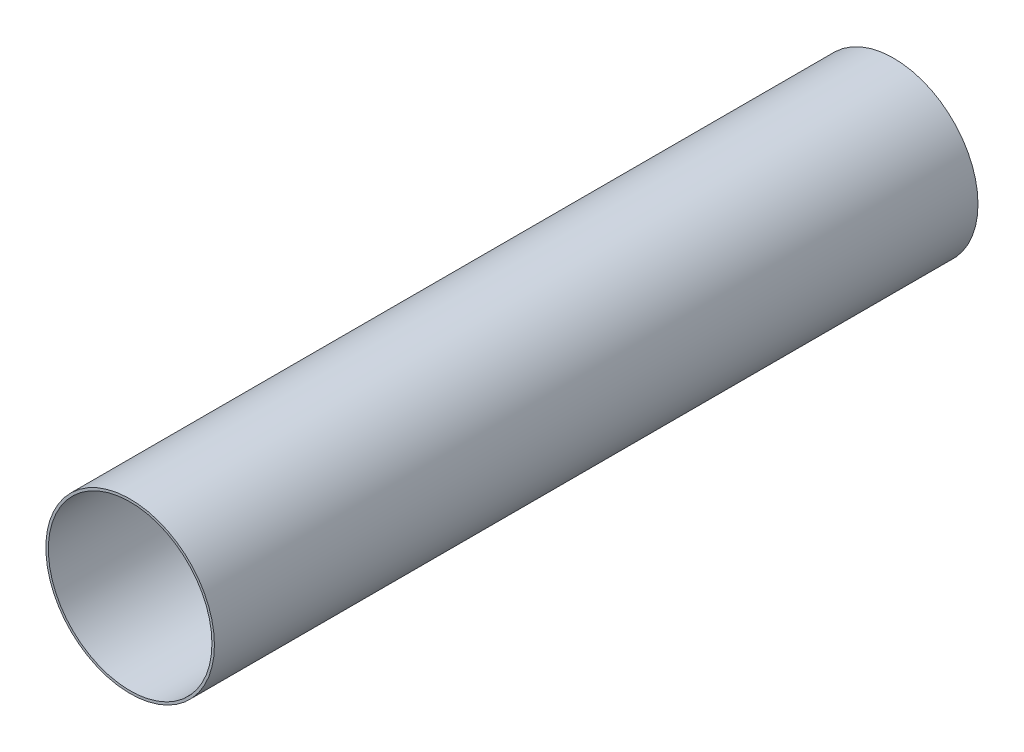
ISO-10303-21;
HEADER;
FILE_DESCRIPTION(('STEP AP214'),'2;1');
FILE_NAME('part.step','',(''),(''),'','','');
FILE_SCHEMA(('AUTOMOTIVE_DESIGN { 1 0 10303 214 1 1 1 1 }'));
ENDSEC;
DATA;
#1=APPLICATION_CONTEXT('core data for automotive mechanical design processes');
#2=APPLICATION_PROTOCOL_DEFINITION('international standard','automotive_design',2000,#1);
#3=PRODUCT_CONTEXT('',#1,'mechanical');
#4=PRODUCT('Part','Part','',(#3));
#5=PRODUCT_RELATED_PRODUCT_CATEGORY('part','',(#4));
#6=PRODUCT_DEFINITION_FORMATION('','',#4);
#7=PRODUCT_DEFINITION_CONTEXT('part definition',#1,'design');
#8=PRODUCT_DEFINITION('design','',#6,#7);
#9=PRODUCT_DEFINITION_SHAPE('','',#8);
#10=(LENGTH_UNIT() NAMED_UNIT(*) SI_UNIT(.MILLI.,.METRE.));
#11=(NAMED_UNIT(*) PLANE_ANGLE_UNIT() SI_UNIT($,.RADIAN.));
#12=(NAMED_UNIT(*) SI_UNIT($,.STERADIAN.) SOLID_ANGLE_UNIT());
#13=UNCERTAINTY_MEASURE_WITH_UNIT(LENGTH_MEASURE(1.E-05),#10,'distance_accuracy_value','');
#14=(GEOMETRIC_REPRESENTATION_CONTEXT(3) GLOBAL_UNCERTAINTY_ASSIGNED_CONTEXT((#13)) GLOBAL_UNIT_ASSIGNED_CONTEXT((#10,
#11,#12)) REPRESENTATION_CONTEXT('',''));
#15=CARTESIAN_POINT('',(0.,0.,0.));
#16=DIRECTION('',(0.,0.,1.));
#17=DIRECTION('',(1.,0.,0.));
#18=AXIS2_PLACEMENT_3D('',#15,#16,#17);
#19=CARTESIAN_POINT('',(0.,0.,177.8));
#20=DIRECTION('',(0.,0.,1.));
#21=DIRECTION('',(1.,0.,0.));
#22=AXIS2_PLACEMENT_3D('',#19,#20,#21);
#23=PLANE('',#22);
#24=CARTESIAN_POINT('',(0.,0.,177.8));
#25=DIRECTION('',(0.,0.,1.));
#26=DIRECTION('',(1.,0.,0.));
#27=AXIS2_PLACEMENT_3D('',#24,#25,#26);
#28=CIRCLE('',#27,39.2557);
#29=CARTESIAN_POINT('',(39.2557,0.,177.8));
#30=VERTEX_POINT('',#29);
#31=EDGE_CURVE('E10',#30,#30,#28,.T.);
#32=ORIENTED_EDGE('',*,*,#31,.T.);
#33=EDGE_LOOP('',(#32));
#34=FACE_BOUND('',#33,.T.);
#35=CARTESIAN_POINT('',(0.,0.,177.8));
#36=DIRECTION('',(0.,0.,1.));
#37=DIRECTION('',(1.,0.,0.));
#38=AXIS2_PLACEMENT_3D('',#35,#36,#37);
#39=CIRCLE('',#38,38.1);
#40=CARTESIAN_POINT('',(38.1,0.,177.8));
#41=VERTEX_POINT('',#40);
#42=EDGE_CURVE('E54',#41,#41,#39,.T.);
#43=ORIENTED_EDGE('',*,*,#42,.F.);
#44=EDGE_LOOP('',(#43));
#45=FACE_BOUND('',#44,.T.);
#46=ADVANCED_FACE('F43',(#34,#45),#23,.T.);
#47=CARTESIAN_POINT('',(0.,0.,-177.8));
#48=DIRECTION('',(0.,0.,1.));
#49=DIRECTION('',(1.,0.,0.));
#50=AXIS2_PLACEMENT_3D('',#47,#48,#49);
#51=PLANE('',#50);
#52=CARTESIAN_POINT('',(0.,0.,-177.8));
#53=DIRECTION('',(0.,0.,1.));
#54=DIRECTION('',(1.,0.,0.));
#55=AXIS2_PLACEMENT_3D('',#52,#53,#54);
#56=CIRCLE('',#55,39.2557);
#57=CARTESIAN_POINT('',(39.2557,0.,-177.8));
#58=VERTEX_POINT('',#57);
#59=EDGE_CURVE('E47',#58,#58,#56,.T.);
#60=ORIENTED_EDGE('',*,*,#59,.F.);
#61=EDGE_LOOP('',(#60));
#62=FACE_BOUND('',#61,.T.);
#63=CARTESIAN_POINT('',(0.,0.,-177.8));
#64=DIRECTION('',(0.,0.,1.));
#65=DIRECTION('',(1.,0.,0.));
#66=AXIS2_PLACEMENT_3D('',#63,#64,#65);
#67=CIRCLE('',#66,38.1);
#68=CARTESIAN_POINT('',(38.1,0.,-177.8));
#69=VERTEX_POINT('',#68);
#70=EDGE_CURVE('E56',#69,#69,#67,.T.);
#71=ORIENTED_EDGE('',*,*,#70,.T.);
#72=EDGE_LOOP('',(#71));
#73=FACE_BOUND('',#72,.T.);
#74=ADVANCED_FACE('F66',(#62,#73),#51,.F.);
#75=CARTESIAN_POINT('',(0.,0.,177.8));
#76=DIRECTION('',(0.,0.,-1.));
#77=DIRECTION('',(-1.,0.,0.));
#78=AXIS2_PLACEMENT_3D('',#75,#76,#77);
#79=CYLINDRICAL_SURFACE('',#78,39.2557);
#80=ORIENTED_EDGE('',*,*,#31,.F.);
#81=EDGE_LOOP('',(#80));
#82=FACE_BOUND('',#81,.T.);
#83=ORIENTED_EDGE('',*,*,#59,.T.);
#84=EDGE_LOOP('',(#83));
#85=FACE_BOUND('',#84,.T.);
#86=ADVANCED_FACE('F45',(#82,#85),#79,.T.);
#87=CARTESIAN_POINT('',(0.,0.,177.8));
#88=DIRECTION('',(0.,0.,-1.));
#89=DIRECTION('',(-1.,0.,0.));
#90=AXIS2_PLACEMENT_3D('',#87,#88,#89);
#91=CYLINDRICAL_SURFACE('',#90,38.1);
#92=ORIENTED_EDGE('',*,*,#42,.T.);
#93=EDGE_LOOP('',(#92));
#94=FACE_BOUND('',#93,.T.);
#95=ORIENTED_EDGE('',*,*,#70,.F.);
#96=EDGE_LOOP('',(#95));
#97=FACE_BOUND('',#96,.T.);
#98=ADVANCED_FACE('F62',(#94,#97),#91,.F.);
#99=CLOSED_SHELL('',(#46,#74,#86,#98));
#100=MANIFOLD_SOLID_BREP('B2',#99);
#101=ADVANCED_BREP_SHAPE_REPRESENTATION('',(#18,#100),#14);
#102=SHAPE_DEFINITION_REPRESENTATION(#9,#101);
ENDSEC;
END-ISO-10303-21;
